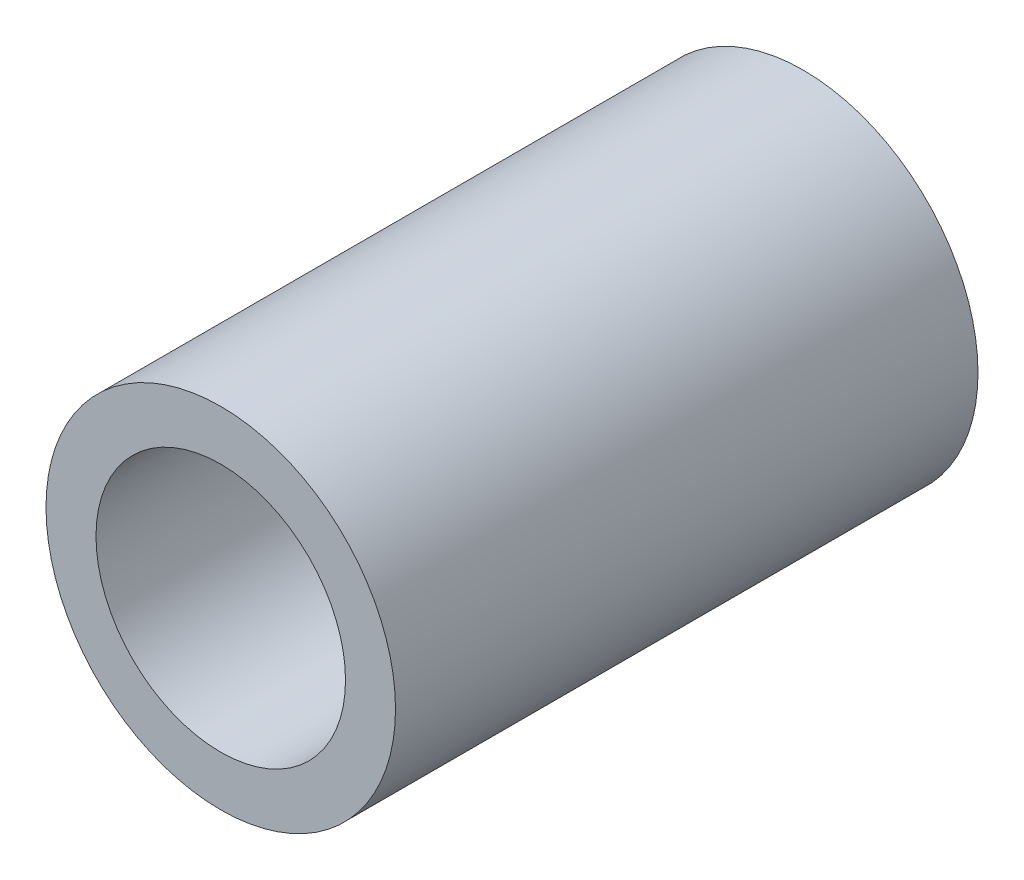
ISO-10303-21;
HEADER;
FILE_DESCRIPTION(('STEP AP214'),'2;1');
FILE_NAME('part.step','',(''),(''),'','','');
FILE_SCHEMA(('AUTOMOTIVE_DESIGN { 1 0 10303 214 1 1 1 1 }'));
ENDSEC;
DATA;
#1=APPLICATION_CONTEXT('core data for automotive mechanical design processes');
#2=APPLICATION_PROTOCOL_DEFINITION('international standard','automotive_design',2000,#1);
#3=PRODUCT_CONTEXT('',#1,'mechanical');
#4=PRODUCT('Part','Part','',(#3));
#5=PRODUCT_RELATED_PRODUCT_CATEGORY('part','',(#4));
#6=PRODUCT_DEFINITION_FORMATION('','',#4);
#7=PRODUCT_DEFINITION_CONTEXT('part definition',#1,'design');
#8=PRODUCT_DEFINITION('design','',#6,#7);
#9=PRODUCT_DEFINITION_SHAPE('','',#8);
#10=(LENGTH_UNIT() NAMED_UNIT(*) SI_UNIT(.MILLI.,.METRE.));
#11=(NAMED_UNIT(*) PLANE_ANGLE_UNIT() SI_UNIT($,.RADIAN.));
#12=(NAMED_UNIT(*) SI_UNIT($,.STERADIAN.) SOLID_ANGLE_UNIT());
#13=UNCERTAINTY_MEASURE_WITH_UNIT(LENGTH_MEASURE(1.E-05),#10,'distance_accuracy_value','');
#14=(GEOMETRIC_REPRESENTATION_CONTEXT(3) GLOBAL_UNCERTAINTY_ASSIGNED_CONTEXT((#13)) GLOBAL_UNIT_ASSIGNED_CONTEXT((#10,
#11,#12)) REPRESENTATION_CONTEXT('',''));
#15=CARTESIAN_POINT('',(0.,0.,0.));
#16=DIRECTION('',(0.,0.,1.));
#17=DIRECTION('',(1.,0.,0.));
#18=AXIS2_PLACEMENT_3D('',#15,#16,#17);
#19=CARTESIAN_POINT('',(0.,0.,3.96875));
#20=DIRECTION('',(0.,0.,1.));
#21=DIRECTION('',(1.,0.,0.));
#22=AXIS2_PLACEMENT_3D('',#19,#20,#21);
#23=PLANE('',#22);
#24=CARTESIAN_POINT('',(0.,0.,3.96875));
#25=DIRECTION('',(0.,0.,1.));
#26=DIRECTION('',(1.,0.,0.));
#27=AXIS2_PLACEMENT_3D('',#24,#25,#26);
#28=CIRCLE('',#27,2.38125);
#29=CARTESIAN_POINT('',(2.38125,0.,3.96875));
#30=VERTEX_POINT('',#29);
#31=EDGE_CURVE('E10',#30,#30,#28,.T.);
#32=ORIENTED_EDGE('',*,*,#31,.T.);
#33=EDGE_LOOP('',(#32));
#34=FACE_BOUND('',#33,.T.);
#35=CARTESIAN_POINT('',(0.,0.,3.96875));
#36=DIRECTION('',(0.,0.,1.));
#37=DIRECTION('',(1.,0.,0.));
#38=AXIS2_PLACEMENT_3D('',#35,#36,#37);
#39=CIRCLE('',#38,1.7);
#40=CARTESIAN_POINT('',(1.7,0.,3.96875));
#41=VERTEX_POINT('',#40);
#42=EDGE_CURVE('E42',#41,#41,#39,.T.);
#43=ORIENTED_EDGE('',*,*,#42,.F.);
#44=EDGE_LOOP('',(#43));
#45=FACE_BOUND('',#44,.T.);
#46=ADVANCED_FACE('F31',(#34,#45),#23,.T.);
#47=CARTESIAN_POINT('',(0.,0.,-3.96875));
#48=DIRECTION('',(0.,0.,1.));
#49=DIRECTION('',(1.,0.,0.));
#50=AXIS2_PLACEMENT_3D('',#47,#48,#49);
#51=PLANE('',#50);
#52=CARTESIAN_POINT('',(0.,0.,-3.96875));
#53=DIRECTION('',(0.,0.,1.));
#54=DIRECTION('',(1.,0.,0.));
#55=AXIS2_PLACEMENT_3D('',#52,#53,#54);
#56=CIRCLE('',#55,2.38125);
#57=CARTESIAN_POINT('',(2.38125,0.,-3.96875));
#58=VERTEX_POINT('',#57);
#59=EDGE_CURVE('E35',#58,#58,#56,.T.);
#60=ORIENTED_EDGE('',*,*,#59,.F.);
#61=EDGE_LOOP('',(#60));
#62=FACE_BOUND('',#61,.T.);
#63=CARTESIAN_POINT('',(0.,0.,-3.96875));
#64=DIRECTION('',(0.,0.,1.));
#65=DIRECTION('',(1.,0.,0.));
#66=AXIS2_PLACEMENT_3D('',#63,#64,#65);
#67=CIRCLE('',#66,1.7);
#68=CARTESIAN_POINT('',(1.7,0.,-3.96875));
#69=VERTEX_POINT('',#68);
#70=EDGE_CURVE('E44',#69,#69,#67,.T.);
#71=ORIENTED_EDGE('',*,*,#70,.T.);
#72=EDGE_LOOP('',(#71));
#73=FACE_BOUND('',#72,.T.);
#74=ADVANCED_FACE('F54',(#62,#73),#51,.F.);
#75=CARTESIAN_POINT('',(0.,0.,3.96875));
#76=DIRECTION('',(0.,0.,-1.));
#77=DIRECTION('',(-1.,0.,0.));
#78=AXIS2_PLACEMENT_3D('',#75,#76,#77);
#79=CYLINDRICAL_SURFACE('',#78,2.38125);
#80=ORIENTED_EDGE('',*,*,#31,.F.);
#81=EDGE_LOOP('',(#80));
#82=FACE_BOUND('',#81,.T.);
#83=ORIENTED_EDGE('',*,*,#59,.T.);
#84=EDGE_LOOP('',(#83));
#85=FACE_BOUND('',#84,.T.);
#86=ADVANCED_FACE('F33',(#82,#85),#79,.T.);
#87=CARTESIAN_POINT('',(0.,0.,3.96875));
#88=DIRECTION('',(0.,0.,-1.));
#89=DIRECTION('',(-1.,0.,0.));
#90=AXIS2_PLACEMENT_3D('',#87,#88,#89);
#91=CYLINDRICAL_SURFACE('',#90,1.7);
#92=ORIENTED_EDGE('',*,*,#42,.T.);
#93=EDGE_LOOP('',(#92));
#94=FACE_BOUND('',#93,.T.);
#95=ORIENTED_EDGE('',*,*,#70,.F.);
#96=EDGE_LOOP('',(#95));
#97=FACE_BOUND('',#96,.T.);
#98=ADVANCED_FACE('F50',(#94,#97),#91,.F.);
#99=CLOSED_SHELL('',(#46,#74,#86,#98));
#100=MANIFOLD_SOLID_BREP('B2',#99);
#101=ADVANCED_BREP_SHAPE_REPRESENTATION('',(#18,#100),#14);
#102=SHAPE_DEFINITION_REPRESENTATION(#9,#101);
ENDSEC;
END-ISO-10303-21;
